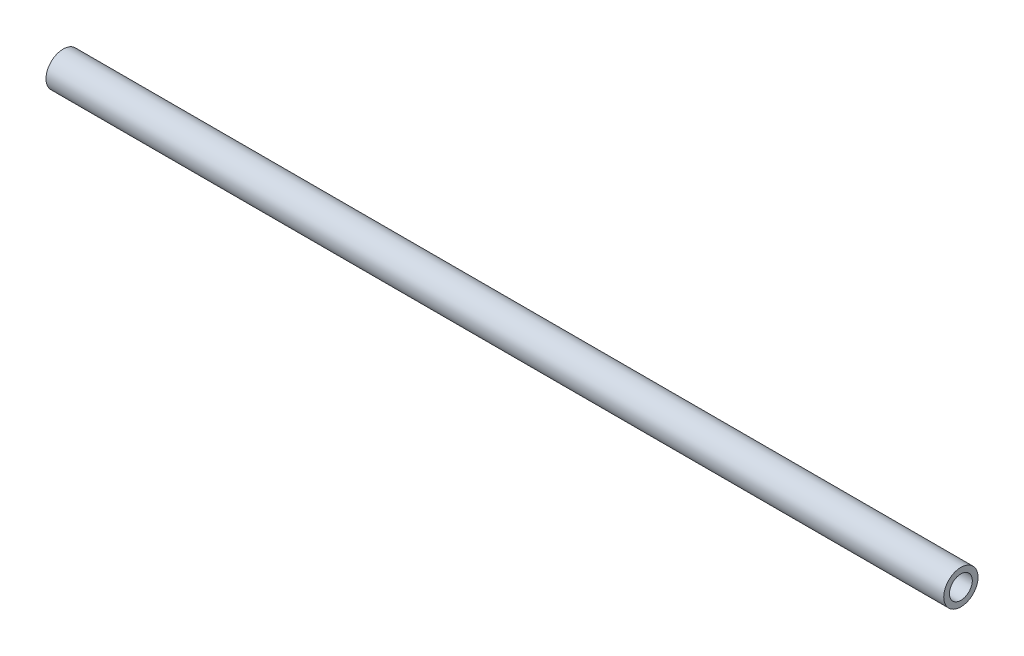
ISO-10303-21;
HEADER;
FILE_DESCRIPTION(('STEP AP214'),'2;1');
FILE_NAME('part.step','',(''),(''),'','','');
FILE_SCHEMA(('AUTOMOTIVE_DESIGN { 1 0 10303 214 1 1 1 1 }'));
ENDSEC;
DATA;
#1=APPLICATION_CONTEXT('core data for automotive mechanical design processes');
#2=APPLICATION_PROTOCOL_DEFINITION('international standard','automotive_design',2000,#1);
#3=PRODUCT_CONTEXT('',#1,'mechanical');
#4=PRODUCT('Part','Part','',(#3));
#5=PRODUCT_RELATED_PRODUCT_CATEGORY('part','',(#4));
#6=PRODUCT_DEFINITION_FORMATION('','',#4);
#7=PRODUCT_DEFINITION_CONTEXT('part definition',#1,'design');
#8=PRODUCT_DEFINITION('design','',#6,#7);
#9=PRODUCT_DEFINITION_SHAPE('','',#8);
#10=(LENGTH_UNIT() NAMED_UNIT(*) SI_UNIT(.MILLI.,.METRE.));
#11=(NAMED_UNIT(*) PLANE_ANGLE_UNIT() SI_UNIT($,.RADIAN.));
#12=(NAMED_UNIT(*) SI_UNIT($,.STERADIAN.) SOLID_ANGLE_UNIT());
#13=UNCERTAINTY_MEASURE_WITH_UNIT(LENGTH_MEASURE(1.E-05),#10,'distance_accuracy_value','');
#14=(GEOMETRIC_REPRESENTATION_CONTEXT(3) GLOBAL_UNCERTAINTY_ASSIGNED_CONTEXT((#13)) GLOBAL_UNIT_ASSIGNED_CONTEXT((#10,
#11,#12)) REPRESENTATION_CONTEXT('',''));
#15=CARTESIAN_POINT('',(0.,0.,0.));
#16=DIRECTION('',(0.,0.,1.));
#17=DIRECTION('',(1.,0.,0.));
#18=AXIS2_PLACEMENT_3D('',#15,#16,#17);
#19=CARTESIAN_POINT('',(0.,0.,0.));
#20=DIRECTION('',(-1.,0.,0.));
#21=DIRECTION('',(0.,0.,1.));
#22=AXIS2_PLACEMENT_3D('',#19,#20,#21);
#23=CYLINDRICAL_SURFACE('',#22,3.00000000000001);
#24=CARTESIAN_POINT('',(0.,0.,0.));
#25=DIRECTION('',(-1.,0.,0.));
#26=DIRECTION('',(0.,0.,1.));
#27=AXIS2_PLACEMENT_3D('',#24,#25,#26);
#28=CIRCLE('',#27,3.);
#29=CARTESIAN_POINT('',(0.,0.,3.));
#30=VERTEX_POINT('',#29);
#31=EDGE_CURVE('E10',#30,#30,#28,.T.);
#32=ORIENTED_EDGE('',*,*,#31,.T.);
#33=EDGE_LOOP('',(#32));
#34=FACE_BOUND('',#33,.T.);
#35=CARTESIAN_POINT('',(-157.,0.,0.));
#36=DIRECTION('',(-1.,0.,0.));
#37=DIRECTION('',(0.,0.,1.));
#38=AXIS2_PLACEMENT_3D('',#35,#36,#37);
#39=CIRCLE('',#38,3.00000000000002);
#40=CARTESIAN_POINT('',(-157.,0.,3.00000000000002));
#41=VERTEX_POINT('',#40);
#42=EDGE_CURVE('E50',#41,#41,#39,.T.);
#43=ORIENTED_EDGE('',*,*,#42,.F.);
#44=EDGE_LOOP('',(#43));
#45=FACE_BOUND('',#44,.T.);
#46=ADVANCED_FACE('F43',(#34,#45),#23,.T.);
#47=CARTESIAN_POINT('',(0.,3.,0.));
#48=DIRECTION('',(1.,0.,0.));
#49=DIRECTION('',(0.,0.,-1.));
#50=AXIS2_PLACEMENT_3D('',#47,#48,#49);
#51=PLANE('',#50);
#52=CARTESIAN_POINT('',(0.,0.,0.));
#53=DIRECTION('',(-1.,0.,0.));
#54=DIRECTION('',(0.,0.,1.));
#55=AXIS2_PLACEMENT_3D('',#52,#53,#54);
#56=CIRCLE('',#55,2.00000000000002);
#57=CARTESIAN_POINT('',(0.,0.,2.00000000000002));
#58=VERTEX_POINT('',#57);
#59=EDGE_CURVE('E55',#58,#58,#56,.T.);
#60=ORIENTED_EDGE('',*,*,#59,.T.);
#61=EDGE_LOOP('',(#60));
#62=FACE_BOUND('',#61,.T.);
#63=ORIENTED_EDGE('',*,*,#31,.F.);
#64=EDGE_LOOP('',(#63));
#65=FACE_BOUND('',#64,.T.);
#66=ADVANCED_FACE('F71',(#62,#65),#51,.T.);
#67=CARTESIAN_POINT('',(-157.,0.,0.));
#68=DIRECTION('',(-1.,0.,0.));
#69=DIRECTION('',(0.,0.,1.));
#70=AXIS2_PLACEMENT_3D('',#67,#68,#69);
#71=PLANE('',#70);
#72=CARTESIAN_POINT('',(-157.,0.,0.));
#73=DIRECTION('',(-1.,0.,0.));
#74=DIRECTION('',(0.,0.,1.));
#75=AXIS2_PLACEMENT_3D('',#72,#73,#74);
#76=CIRCLE('',#75,2.00000000000002);
#77=CARTESIAN_POINT('',(-157.,0.,2.00000000000002));
#78=VERTEX_POINT('',#77);
#79=EDGE_CURVE('E60',#78,#78,#76,.T.);
#80=ORIENTED_EDGE('',*,*,#79,.F.);
#81=EDGE_LOOP('',(#80));
#82=FACE_BOUND('',#81,.T.);
#83=ORIENTED_EDGE('',*,*,#42,.T.);
#84=EDGE_LOOP('',(#83));
#85=FACE_BOUND('',#84,.T.);
#86=ADVANCED_FACE('F69',(#82,#85),#71,.T.);
#87=CARTESIAN_POINT('',(0.,0.,0.));
#88=DIRECTION('',(-1.,0.,0.));
#89=DIRECTION('',(0.,0.,1.));
#90=AXIS2_PLACEMENT_3D('',#87,#88,#89);
#91=CYLINDRICAL_SURFACE('',#90,2.00000000000002);
#92=ORIENTED_EDGE('',*,*,#59,.F.);
#93=EDGE_LOOP('',(#92));
#94=FACE_BOUND('',#93,.T.);
#95=ORIENTED_EDGE('',*,*,#79,.T.);
#96=EDGE_LOOP('',(#95));
#97=FACE_BOUND('',#96,.T.);
#98=ADVANCED_FACE('F67',(#94,#97),#91,.F.);
#99=CLOSED_SHELL('',(#46,#66,#86,#98));
#100=MANIFOLD_SOLID_BREP('B2',#99);
#101=ADVANCED_BREP_SHAPE_REPRESENTATION('',(#18,#100),#14);
#102=SHAPE_DEFINITION_REPRESENTATION(#9,#101);
ENDSEC;
END-ISO-10303-21;
